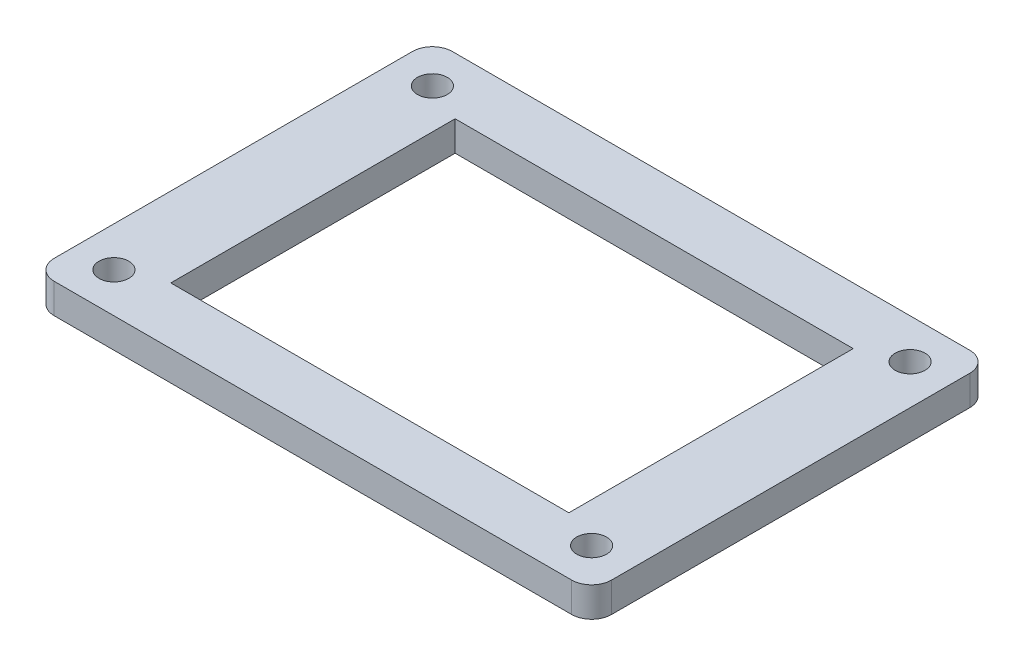
ISO-10303-21;
HEADER;
FILE_DESCRIPTION(('STEP AP214'),'2;1');
FILE_NAME('part.step','',(''),(''),'','','');
FILE_SCHEMA(('AUTOMOTIVE_DESIGN { 1 0 10303 214 1 1 1 1 }'));
ENDSEC;
DATA;
#1=APPLICATION_CONTEXT('core data for automotive mechanical design processes');
#2=APPLICATION_PROTOCOL_DEFINITION('international standard','automotive_design',2000,#1);
#3=PRODUCT_CONTEXT('',#1,'mechanical');
#4=PRODUCT('Part','Part','',(#3));
#5=PRODUCT_RELATED_PRODUCT_CATEGORY('part','',(#4));
#6=PRODUCT_DEFINITION_FORMATION('','',#4);
#7=PRODUCT_DEFINITION_CONTEXT('part definition',#1,'design');
#8=PRODUCT_DEFINITION('design','',#6,#7);
#9=PRODUCT_DEFINITION_SHAPE('','',#8);
#10=(LENGTH_UNIT() NAMED_UNIT(*) SI_UNIT(.MILLI.,.METRE.));
#11=(NAMED_UNIT(*) PLANE_ANGLE_UNIT() SI_UNIT($,.RADIAN.));
#12=(NAMED_UNIT(*) SI_UNIT($,.STERADIAN.) SOLID_ANGLE_UNIT());
#13=UNCERTAINTY_MEASURE_WITH_UNIT(LENGTH_MEASURE(1.E-05),#10,'distance_accuracy_value','');
#14=(GEOMETRIC_REPRESENTATION_CONTEXT(3) GLOBAL_UNCERTAINTY_ASSIGNED_CONTEXT((#13)) GLOBAL_UNIT_ASSIGNED_CONTEXT((#10,
#11,#12)) REPRESENTATION_CONTEXT('',''));
#15=CARTESIAN_POINT('',(0.,0.,0.));
#16=DIRECTION('',(0.,0.,1.));
#17=DIRECTION('',(1.,0.,0.));
#18=AXIS2_PLACEMENT_3D('',#15,#16,#17);
#19=CARTESIAN_POINT('',(0.,3.,0.));
#20=DIRECTION('',(0.,-1.,0.));
#21=DIRECTION('',(0.,0.,-1.));
#22=AXIS2_PLACEMENT_3D('',#19,#20,#21);
#23=PLANE('',#22);
#24=CARTESIAN_POINT('',(-23.9999999999956,3.,-16.0000000000008));
#25=DIRECTION('',(0.,-1.,0.));
#26=DIRECTION('',(0.,0.,-1.));
#27=AXIS2_PLACEMENT_3D('',#24,#25,#26);
#28=CIRCLE('',#27,1.5);
#29=CARTESIAN_POINT('',(-23.9999999999956,3.,-17.5000000000008));
#30=VERTEX_POINT('',#29);
#31=EDGE_CURVE('E429',#30,#30,#28,.T.);
#32=ORIENTED_EDGE('',*,*,#31,.T.);
#33=EDGE_LOOP('',(#32));
#34=FACE_BOUND('',#33,.T.);
#35=CARTESIAN_POINT('',(24.0000000000047,3.,15.9999999999988));
#36=DIRECTION('',(0.,-1.,0.));
#37=DIRECTION('',(0.,0.,-1.));
#38=AXIS2_PLACEMENT_3D('',#35,#36,#37);
#39=CIRCLE('',#38,1.5);
#40=CARTESIAN_POINT('',(24.0000000000047,3.,14.4999999999988));
#41=VERTEX_POINT('',#40);
#42=EDGE_CURVE('E424',#41,#41,#39,.T.);
#43=ORIENTED_EDGE('',*,*,#42,.T.);
#44=EDGE_LOOP('',(#43));
#45=FACE_BOUND('',#44,.T.);
#46=CARTESIAN_POINT('',(24.0000000000045,3.,-16.0000000000012));
#47=DIRECTION('',(0.,-1.,0.));
#48=DIRECTION('',(0.,0.,-1.));
#49=AXIS2_PLACEMENT_3D('',#46,#47,#48);
#50=CIRCLE('',#49,1.5);
#51=CARTESIAN_POINT('',(24.0000000000045,3.,-17.5000000000012));
#52=VERTEX_POINT('',#51);
#53=EDGE_CURVE('E417',#52,#52,#50,.T.);
#54=ORIENTED_EDGE('',*,*,#53,.T.);
#55=EDGE_LOOP('',(#54));
#56=FACE_BOUND('',#55,.T.);
#57=CARTESIAN_POINT('',(-23.9999999999953,3.,15.9999999999992));
#58=DIRECTION('',(0.,-1.,0.));
#59=DIRECTION('',(0.,0.,-1.));
#60=AXIS2_PLACEMENT_3D('',#57,#58,#59);
#61=CIRCLE('',#60,1.5);
#62=CARTESIAN_POINT('',(-23.9999999999953,3.,14.4999999999992));
#63=VERTEX_POINT('',#62);
#64=EDGE_CURVE('E156',#63,#63,#61,.T.);
#65=ORIENTED_EDGE('',*,*,#64,.T.);
#66=EDGE_LOOP('',(#65));
#67=FACE_BOUND('',#66,.T.);
#68=DIRECTION('',(1.,0.,0.));
#69=VECTOR('',#68,1.);
#70=CARTESIAN_POINT('',(-28.,3.,20.));
#71=LINE('',#70,#69);
#72=CARTESIAN_POINT('',(-26.,3.,20.));
#73=VERTEX_POINT('',#72);
#74=CARTESIAN_POINT('',(26.,3.,20.));
#75=VERTEX_POINT('',#74);
#76=EDGE_CURVE('E175',#73,#75,#71,.T.);
#77=ORIENTED_EDGE('',*,*,#76,.T.);
#78=CARTESIAN_POINT('',(26.,3.,18.));
#79=DIRECTION('',(0.,-1.,0.));
#80=DIRECTION('',(0.,0.,-1.));
#81=AXIS2_PLACEMENT_3D('',#78,#79,#80);
#82=CIRCLE('',#81,2.);
#83=CARTESIAN_POINT('',(28.,3.,18.));
#84=VERTEX_POINT('',#83);
#85=EDGE_CURVE('E210',#75,#84,#82,.F.);
#86=ORIENTED_EDGE('',*,*,#85,.T.);
#87=DIRECTION('',(0.,0.,-1.));
#88=VECTOR('',#87,1.);
#89=CARTESIAN_POINT('',(28.,3.,20.));
#90=LINE('',#89,#88);
#91=CARTESIAN_POINT('',(28.,3.,-18.));
#92=VERTEX_POINT('',#91);
#93=EDGE_CURVE('E167',#84,#92,#90,.T.);
#94=ORIENTED_EDGE('',*,*,#93,.T.);
#95=CARTESIAN_POINT('',(26.,3.,-18.));
#96=DIRECTION('',(0.,-1.,0.));
#97=DIRECTION('',(0.,0.,-1.));
#98=AXIS2_PLACEMENT_3D('',#95,#96,#97);
#99=CIRCLE('',#98,2.);
#100=CARTESIAN_POINT('',(26.,3.,-20.));
#101=VERTEX_POINT('',#100);
#102=EDGE_CURVE('E208',#92,#101,#99,.F.);
#103=ORIENTED_EDGE('',*,*,#102,.T.);
#104=DIRECTION('',(-1.,0.,0.));
#105=VECTOR('',#104,1.);
#106=CARTESIAN_POINT('',(-28.,3.,-20.));
#107=LINE('',#106,#105);
#108=CARTESIAN_POINT('',(-26.,3.,-20.));
#109=VERTEX_POINT('',#108);
#110=EDGE_CURVE('E170',#101,#109,#107,.T.);
#111=ORIENTED_EDGE('',*,*,#110,.T.);
#112=CARTESIAN_POINT('',(-26.,3.,-18.));
#113=DIRECTION('',(0.,-1.,0.));
#114=DIRECTION('',(0.,0.,-1.));
#115=AXIS2_PLACEMENT_3D('',#112,#113,#114);
#116=CIRCLE('',#115,2.);
#117=CARTESIAN_POINT('',(-28.,3.,-18.));
#118=VERTEX_POINT('',#117);
#119=EDGE_CURVE('E54',#109,#118,#116,.F.);
#120=ORIENTED_EDGE('',*,*,#119,.T.);
#121=DIRECTION('',(0.,0.,1.));
#122=VECTOR('',#121,1.);
#123=CARTESIAN_POINT('',(-28.,3.,20.));
#124=LINE('',#123,#122);
#125=CARTESIAN_POINT('',(-28.,3.,18.));
#126=VERTEX_POINT('',#125);
#127=EDGE_CURVE('E173',#118,#126,#124,.T.);
#128=ORIENTED_EDGE('',*,*,#127,.T.);
#129=CARTESIAN_POINT('',(-26.,3.,18.));
#130=DIRECTION('',(0.,-1.,0.));
#131=DIRECTION('',(0.,0.,-1.));
#132=AXIS2_PLACEMENT_3D('',#129,#130,#131);
#133=CIRCLE('',#132,2.);
#134=EDGE_CURVE('E205',#126,#73,#133,.F.);
#135=ORIENTED_EDGE('',*,*,#134,.T.);
#136=EDGE_LOOP('',(#77,#86,#94,#103,#111,#120,#128,#135));
#137=FACE_BOUND('',#136,.T.);
#138=DIRECTION('',(0.,0.,-1.));
#139=VECTOR('',#138,1.);
#140=CARTESIAN_POINT('',(20.,3.,14.2857142857143));
#141=LINE('',#140,#139);
#142=CARTESIAN_POINT('',(20.,3.,14.2857142857143));
#143=VERTEX_POINT('',#142);
#144=CARTESIAN_POINT('',(20.,3.,-14.2857142857143));
#145=VERTEX_POINT('',#144);
#146=EDGE_CURVE('E124',#143,#145,#141,.T.);
#147=ORIENTED_EDGE('',*,*,#146,.F.);
#148=DIRECTION('',(1.,0.,0.));
#149=VECTOR('',#148,1.);
#150=CARTESIAN_POINT('',(-20.,3.,14.2857142857143));
#151=LINE('',#150,#149);
#152=CARTESIAN_POINT('',(-20.,3.,14.2857142857143));
#153=VERTEX_POINT('',#152);
#154=EDGE_CURVE('E149',#153,#143,#151,.T.);
#155=ORIENTED_EDGE('',*,*,#154,.F.);
#156=DIRECTION('',(0.,0.,1.));
#157=VECTOR('',#156,1.);
#158=CARTESIAN_POINT('',(-20.,3.,14.2857142857143));
#159=LINE('',#158,#157);
#160=CARTESIAN_POINT('',(-20.,3.,-14.2857142857143));
#161=VERTEX_POINT('',#160);
#162=EDGE_CURVE('E147',#161,#153,#159,.T.);
#163=ORIENTED_EDGE('',*,*,#162,.F.);
#164=DIRECTION('',(-1.,0.,0.));
#165=VECTOR('',#164,1.);
#166=CARTESIAN_POINT('',(-20.,3.,-14.2857142857143));
#167=LINE('',#166,#165);
#168=EDGE_CURVE('E134',#145,#161,#167,.T.);
#169=ORIENTED_EDGE('',*,*,#168,.F.);
#170=EDGE_LOOP('',(#147,#155,#163,#169));
#171=FACE_BOUND('',#170,.T.);
#172=ADVANCED_FACE('F33',(#34,#45,#56,#67,#137,#171),#23,.F.);
#173=CARTESIAN_POINT('',(0.,0.,0.));
#174=DIRECTION('',(0.,-1.,0.));
#175=DIRECTION('',(0.,0.,-1.));
#176=AXIS2_PLACEMENT_3D('',#173,#174,#175);
#177=PLANE('',#176);
#178=CARTESIAN_POINT('',(-23.9999999999956,0.,-16.0000000000008));
#179=DIRECTION('',(0.,-1.,0.));
#180=DIRECTION('',(0.,0.,-1.));
#181=AXIS2_PLACEMENT_3D('',#178,#179,#180);
#182=CIRCLE('',#181,1.5);
#183=CARTESIAN_POINT('',(-23.9999999999956,0.,-17.5000000000008));
#184=VERTEX_POINT('',#183);
#185=EDGE_CURVE('E432',#184,#184,#182,.T.);
#186=ORIENTED_EDGE('',*,*,#185,.F.);
#187=EDGE_LOOP('',(#186));
#188=FACE_BOUND('',#187,.T.);
#189=CARTESIAN_POINT('',(24.0000000000047,0.,15.9999999999988));
#190=DIRECTION('',(0.,-1.,0.));
#191=DIRECTION('',(0.,0.,-1.));
#192=AXIS2_PLACEMENT_3D('',#189,#190,#191);
#193=CIRCLE('',#192,1.5);
#194=CARTESIAN_POINT('',(24.0000000000047,0.,14.4999999999988));
#195=VERTEX_POINT('',#194);
#196=EDGE_CURVE('E426',#195,#195,#193,.T.);
#197=ORIENTED_EDGE('',*,*,#196,.F.);
#198=EDGE_LOOP('',(#197));
#199=FACE_BOUND('',#198,.T.);
#200=CARTESIAN_POINT('',(24.0000000000045,0.,-16.0000000000012));
#201=DIRECTION('',(0.,-1.,0.));
#202=DIRECTION('',(0.,0.,-1.));
#203=AXIS2_PLACEMENT_3D('',#200,#201,#202);
#204=CIRCLE('',#203,1.5);
#205=CARTESIAN_POINT('',(24.0000000000045,0.,-17.5000000000012));
#206=VERTEX_POINT('',#205);
#207=EDGE_CURVE('E420',#206,#206,#204,.T.);
#208=ORIENTED_EDGE('',*,*,#207,.F.);
#209=EDGE_LOOP('',(#208));
#210=FACE_BOUND('',#209,.T.);
#211=CARTESIAN_POINT('',(-23.9999999999953,0.,15.9999999999992));
#212=DIRECTION('',(0.,-1.,0.));
#213=DIRECTION('',(0.,0.,-1.));
#214=AXIS2_PLACEMENT_3D('',#211,#212,#213);
#215=CIRCLE('',#214,1.5);
#216=CARTESIAN_POINT('',(-23.9999999999953,0.,14.4999999999992));
#217=VERTEX_POINT('',#216);
#218=EDGE_CURVE('E415',#217,#217,#215,.T.);
#219=ORIENTED_EDGE('',*,*,#218,.F.);
#220=EDGE_LOOP('',(#219));
#221=FACE_BOUND('',#220,.T.);
#222=DIRECTION('',(0.,0.,-1.));
#223=VECTOR('',#222,1.);
#224=CARTESIAN_POINT('',(28.,0.,20.));
#225=LINE('',#224,#223);
#226=CARTESIAN_POINT('',(28.,0.,18.));
#227=VERTEX_POINT('',#226);
#228=CARTESIAN_POINT('',(28.,0.,-18.));
#229=VERTEX_POINT('',#228);
#230=EDGE_CURVE('E142',#227,#229,#225,.T.);
#231=ORIENTED_EDGE('',*,*,#230,.F.);
#232=CARTESIAN_POINT('',(26.,0.,18.));
#233=DIRECTION('',(0.,-1.,0.));
#234=DIRECTION('',(0.,0.,-1.));
#235=AXIS2_PLACEMENT_3D('',#232,#233,#234);
#236=CIRCLE('',#235,2.);
#237=CARTESIAN_POINT('',(26.,0.,20.));
#238=VERTEX_POINT('',#237);
#239=EDGE_CURVE('E198',#227,#238,#236,.T.);
#240=ORIENTED_EDGE('',*,*,#239,.T.);
#241=DIRECTION('',(1.,0.,0.));
#242=VECTOR('',#241,1.);
#243=CARTESIAN_POINT('',(-28.,0.,20.));
#244=LINE('',#243,#242);
#245=CARTESIAN_POINT('',(-26.,0.,20.));
#246=VERTEX_POINT('',#245);
#247=EDGE_CURVE('E171',#246,#238,#244,.T.);
#248=ORIENTED_EDGE('',*,*,#247,.F.);
#249=CARTESIAN_POINT('',(-26.,0.,18.));
#250=DIRECTION('',(0.,-1.,0.));
#251=DIRECTION('',(0.,0.,-1.));
#252=AXIS2_PLACEMENT_3D('',#249,#250,#251);
#253=CIRCLE('',#252,2.);
#254=CARTESIAN_POINT('',(-28.,0.,18.));
#255=VERTEX_POINT('',#254);
#256=EDGE_CURVE('E192',#246,#255,#253,.T.);
#257=ORIENTED_EDGE('',*,*,#256,.T.);
#258=DIRECTION('',(0.,0.,1.));
#259=VECTOR('',#258,1.);
#260=CARTESIAN_POINT('',(-28.,0.,20.));
#261=LINE('',#260,#259);
#262=CARTESIAN_POINT('',(-28.,0.,-18.));
#263=VERTEX_POINT('',#262);
#264=EDGE_CURVE('E184',#263,#255,#261,.T.);
#265=ORIENTED_EDGE('',*,*,#264,.F.);
#266=CARTESIAN_POINT('',(-26.,0.,-18.));
#267=DIRECTION('',(0.,-1.,0.));
#268=DIRECTION('',(0.,0.,-1.));
#269=AXIS2_PLACEMENT_3D('',#266,#267,#268);
#270=CIRCLE('',#269,2.);
#271=CARTESIAN_POINT('',(-26.,0.,-20.));
#272=VERTEX_POINT('',#271);
#273=EDGE_CURVE('E194',#263,#272,#270,.T.);
#274=ORIENTED_EDGE('',*,*,#273,.T.);
#275=DIRECTION('',(-1.,0.,0.));
#276=VECTOR('',#275,1.);
#277=CARTESIAN_POINT('',(-28.,0.,-20.));
#278=LINE('',#277,#276);
#279=CARTESIAN_POINT('',(26.,0.,-20.));
#280=VERTEX_POINT('',#279);
#281=EDGE_CURVE('E181',#280,#272,#278,.T.);
#282=ORIENTED_EDGE('',*,*,#281,.F.);
#283=CARTESIAN_POINT('',(26.,0.,-18.));
#284=DIRECTION('',(0.,-1.,0.));
#285=DIRECTION('',(0.,0.,-1.));
#286=AXIS2_PLACEMENT_3D('',#283,#284,#285);
#287=CIRCLE('',#286,2.);
#288=EDGE_CURVE('E196',#280,#229,#287,.T.);
#289=ORIENTED_EDGE('',*,*,#288,.T.);
#290=EDGE_LOOP('',(#231,#240,#248,#257,#265,#274,#282,#289));
#291=FACE_BOUND('',#290,.T.);
#292=DIRECTION('',(1.,0.,0.));
#293=VECTOR('',#292,1.);
#294=CARTESIAN_POINT('',(-20.,0.,14.2857142857143));
#295=LINE('',#294,#293);
#296=CARTESIAN_POINT('',(-20.,0.,14.2857142857143));
#297=VERTEX_POINT('',#296);
#298=CARTESIAN_POINT('',(20.,0.,14.2857142857143));
#299=VERTEX_POINT('',#298);
#300=EDGE_CURVE('E135',#297,#299,#295,.T.);
#301=ORIENTED_EDGE('',*,*,#300,.T.);
#302=DIRECTION('',(0.,0.,-1.));
#303=VECTOR('',#302,1.);
#304=CARTESIAN_POINT('',(20.,0.,14.2857142857143));
#305=LINE('',#304,#303);
#306=CARTESIAN_POINT('',(20.,0.,-14.2857142857143));
#307=VERTEX_POINT('',#306);
#308=EDGE_CURVE('E154',#299,#307,#305,.T.);
#309=ORIENTED_EDGE('',*,*,#308,.T.);
#310=DIRECTION('',(-1.,0.,0.));
#311=VECTOR('',#310,1.);
#312=CARTESIAN_POINT('',(-20.,0.,-14.2857142857143));
#313=LINE('',#312,#311);
#314=CARTESIAN_POINT('',(-20.,0.,-14.2857142857143));
#315=VERTEX_POINT('',#314);
#316=EDGE_CURVE('E141',#307,#315,#313,.T.);
#317=ORIENTED_EDGE('',*,*,#316,.T.);
#318=DIRECTION('',(0.,0.,1.));
#319=VECTOR('',#318,1.);
#320=CARTESIAN_POINT('',(-20.,0.,14.2857142857143));
#321=LINE('',#320,#319);
#322=EDGE_CURVE('E158',#315,#297,#321,.T.);
#323=ORIENTED_EDGE('',*,*,#322,.T.);
#324=EDGE_LOOP('',(#301,#309,#317,#323));
#325=FACE_BOUND('',#324,.T.);
#326=ADVANCED_FACE('F226',(#188,#199,#210,#221,#291,#325),#177,.T.);
#327=CARTESIAN_POINT('',(28.,3.,20.));
#328=DIRECTION('',(-1.,0.,0.));
#329=DIRECTION('',(0.,0.,1.));
#330=AXIS2_PLACEMENT_3D('',#327,#328,#329);
#331=PLANE('',#330);
#332=ORIENTED_EDGE('',*,*,#93,.F.);
#333=DIRECTION('',(0.,-1.,0.));
#334=VECTOR('',#333,1.);
#335=CARTESIAN_POINT('',(28.,3.,18.));
#336=LINE('',#335,#334);
#337=EDGE_CURVE('E189',#84,#227,#336,.T.);
#338=ORIENTED_EDGE('',*,*,#337,.T.);
#339=ORIENTED_EDGE('',*,*,#230,.T.);
#340=DIRECTION('',(0.,-1.,0.));
#341=VECTOR('',#340,1.);
#342=CARTESIAN_POINT('',(28.,3.,-18.));
#343=LINE('',#342,#341);
#344=EDGE_CURVE('E178',#229,#92,#343,.F.);
#345=ORIENTED_EDGE('',*,*,#344,.T.);
#346=EDGE_LOOP('',(#332,#338,#339,#345));
#347=FACE_BOUND('',#346,.T.);
#348=ADVANCED_FACE('F247',(#347),#331,.F.);
#349=CARTESIAN_POINT('',(-28.,3.,-20.));
#350=DIRECTION('',(0.,0.,1.));
#351=DIRECTION('',(1.,0.,0.));
#352=AXIS2_PLACEMENT_3D('',#349,#350,#351);
#353=PLANE('',#352);
#354=ORIENTED_EDGE('',*,*,#110,.F.);
#355=DIRECTION('',(0.,-1.,0.));
#356=VECTOR('',#355,1.);
#357=CARTESIAN_POINT('',(26.,3.,-20.));
#358=LINE('',#357,#356);
#359=EDGE_CURVE('E214',#101,#280,#358,.T.);
#360=ORIENTED_EDGE('',*,*,#359,.T.);
#361=ORIENTED_EDGE('',*,*,#281,.T.);
#362=DIRECTION('',(0.,-1.,0.));
#363=VECTOR('',#362,1.);
#364=CARTESIAN_POINT('',(-26.,3.,-20.));
#365=LINE('',#364,#363);
#366=EDGE_CURVE('E212',#272,#109,#365,.F.);
#367=ORIENTED_EDGE('',*,*,#366,.T.);
#368=EDGE_LOOP('',(#354,#360,#361,#367));
#369=FACE_BOUND('',#368,.T.);
#370=ADVANCED_FACE('F220',(#369),#353,.F.);
#371=CARTESIAN_POINT('',(-28.,3.,20.));
#372=DIRECTION('',(1.,0.,0.));
#373=DIRECTION('',(0.,0.,-1.));
#374=AXIS2_PLACEMENT_3D('',#371,#372,#373);
#375=PLANE('',#374);
#376=ORIENTED_EDGE('',*,*,#127,.F.);
#377=DIRECTION('',(0.,-1.,0.));
#378=VECTOR('',#377,1.);
#379=CARTESIAN_POINT('',(-28.,3.,-18.));
#380=LINE('',#379,#378);
#381=EDGE_CURVE('E11',#118,#263,#380,.T.);
#382=ORIENTED_EDGE('',*,*,#381,.T.);
#383=ORIENTED_EDGE('',*,*,#264,.T.);
#384=DIRECTION('',(0.,-1.,0.));
#385=VECTOR('',#384,1.);
#386=CARTESIAN_POINT('',(-28.,3.,18.));
#387=LINE('',#386,#385);
#388=EDGE_CURVE('E41',#255,#126,#387,.F.);
#389=ORIENTED_EDGE('',*,*,#388,.T.);
#390=EDGE_LOOP('',(#376,#382,#383,#389));
#391=FACE_BOUND('',#390,.T.);
#392=ADVANCED_FACE('F232',(#391),#375,.F.);
#393=CARTESIAN_POINT('',(-28.,3.,20.));
#394=DIRECTION('',(0.,0.,-1.));
#395=DIRECTION('',(-1.,0.,0.));
#396=AXIS2_PLACEMENT_3D('',#393,#394,#395);
#397=PLANE('',#396);
#398=ORIENTED_EDGE('',*,*,#247,.T.);
#399=DIRECTION('',(0.,-1.,0.));
#400=VECTOR('',#399,1.);
#401=CARTESIAN_POINT('',(26.,3.,20.));
#402=LINE('',#401,#400);
#403=EDGE_CURVE('E203',#238,#75,#402,.F.);
#404=ORIENTED_EDGE('',*,*,#403,.T.);
#405=ORIENTED_EDGE('',*,*,#76,.F.);
#406=DIRECTION('',(0.,-1.,0.));
#407=VECTOR('',#406,1.);
#408=CARTESIAN_POINT('',(-26.,3.,20.));
#409=LINE('',#408,#407);
#410=EDGE_CURVE('E200',#73,#246,#409,.T.);
#411=ORIENTED_EDGE('',*,*,#410,.T.);
#412=EDGE_LOOP('',(#398,#404,#405,#411));
#413=FACE_BOUND('',#412,.T.);
#414=ADVANCED_FACE('F239',(#413),#397,.F.);
#415=CARTESIAN_POINT('',(20.,3.,14.2857142857143));
#416=DIRECTION('',(-1.,0.,0.));
#417=DIRECTION('',(0.,0.,1.));
#418=AXIS2_PLACEMENT_3D('',#415,#416,#417);
#419=PLANE('',#418);
#420=ORIENTED_EDGE('',*,*,#308,.F.);
#421=DIRECTION('',(0.,-1.,0.));
#422=VECTOR('',#421,1.);
#423=CARTESIAN_POINT('',(20.,3.,14.2857142857143));
#424=LINE('',#423,#422);
#425=EDGE_CURVE('E130',#143,#299,#424,.T.);
#426=ORIENTED_EDGE('',*,*,#425,.F.);
#427=ORIENTED_EDGE('',*,*,#146,.T.);
#428=DIRECTION('',(0.,-1.,0.));
#429=VECTOR('',#428,1.);
#430=CARTESIAN_POINT('',(20.,3.,-14.2857142857143));
#431=LINE('',#430,#429);
#432=EDGE_CURVE('E127',#145,#307,#431,.T.);
#433=ORIENTED_EDGE('',*,*,#432,.T.);
#434=EDGE_LOOP('',(#420,#426,#427,#433));
#435=FACE_BOUND('',#434,.T.);
#436=ADVANCED_FACE('F126',(#435),#419,.T.);
#437=CARTESIAN_POINT('',(-20.,3.,-14.2857142857143));
#438=DIRECTION('',(0.,0.,1.));
#439=DIRECTION('',(1.,0.,0.));
#440=AXIS2_PLACEMENT_3D('',#437,#438,#439);
#441=PLANE('',#440);
#442=ORIENTED_EDGE('',*,*,#316,.F.);
#443=ORIENTED_EDGE('',*,*,#432,.F.);
#444=ORIENTED_EDGE('',*,*,#168,.T.);
#445=DIRECTION('',(0.,-1.,0.));
#446=VECTOR('',#445,1.);
#447=CARTESIAN_POINT('',(-20.,3.,-14.2857142857143));
#448=LINE('',#447,#446);
#449=EDGE_CURVE('E143',#161,#315,#448,.T.);
#450=ORIENTED_EDGE('',*,*,#449,.T.);
#451=EDGE_LOOP('',(#442,#443,#444,#450));
#452=FACE_BOUND('',#451,.T.);
#453=ADVANCED_FACE('F138',(#452),#441,.T.);
#454=CARTESIAN_POINT('',(-20.,3.,14.2857142857143));
#455=DIRECTION('',(1.,0.,0.));
#456=DIRECTION('',(0.,0.,-1.));
#457=AXIS2_PLACEMENT_3D('',#454,#455,#456);
#458=PLANE('',#457);
#459=ORIENTED_EDGE('',*,*,#322,.F.);
#460=ORIENTED_EDGE('',*,*,#449,.F.);
#461=ORIENTED_EDGE('',*,*,#162,.T.);
#462=DIRECTION('',(0.,-1.,0.));
#463=VECTOR('',#462,1.);
#464=CARTESIAN_POINT('',(-20.,3.,14.2857142857143));
#465=LINE('',#464,#463);
#466=EDGE_CURVE('E164',#153,#297,#465,.T.);
#467=ORIENTED_EDGE('',*,*,#466,.T.);
#468=EDGE_LOOP('',(#459,#460,#461,#467));
#469=FACE_BOUND('',#468,.T.);
#470=ADVANCED_FACE('F356',(#469),#458,.T.);
#471=CARTESIAN_POINT('',(-20.,3.,14.2857142857143));
#472=DIRECTION('',(0.,0.,-1.));
#473=DIRECTION('',(-1.,0.,0.));
#474=AXIS2_PLACEMENT_3D('',#471,#472,#473);
#475=PLANE('',#474);
#476=ORIENTED_EDGE('',*,*,#300,.F.);
#477=ORIENTED_EDGE('',*,*,#466,.F.);
#478=ORIENTED_EDGE('',*,*,#154,.T.);
#479=ORIENTED_EDGE('',*,*,#425,.T.);
#480=EDGE_LOOP('',(#476,#477,#478,#479));
#481=FACE_BOUND('',#480,.T.);
#482=ADVANCED_FACE('F348',(#481),#475,.T.);
#483=CARTESIAN_POINT('',(-23.9999999999953,3.,15.9999999999992));
#484=DIRECTION('',(0.,-1.,0.));
#485=DIRECTION('',(0.,0.,-1.));
#486=AXIS2_PLACEMENT_3D('',#483,#484,#485);
#487=CYLINDRICAL_SURFACE('',#486,1.5);
#488=ORIENTED_EDGE('',*,*,#64,.F.);
#489=EDGE_LOOP('',(#488));
#490=FACE_BOUND('',#489,.T.);
#491=ORIENTED_EDGE('',*,*,#218,.T.);
#492=EDGE_LOOP('',(#491));
#493=FACE_BOUND('',#492,.T.);
#494=ADVANCED_FACE('F340',(#490,#493),#487,.F.);
#495=CARTESIAN_POINT('',(24.0000000000045,3.,-16.0000000000012));
#496=DIRECTION('',(0.,-1.,0.));
#497=DIRECTION('',(0.,0.,-1.));
#498=AXIS2_PLACEMENT_3D('',#495,#496,#497);
#499=CYLINDRICAL_SURFACE('',#498,1.5);
#500=ORIENTED_EDGE('',*,*,#53,.F.);
#501=EDGE_LOOP('',(#500));
#502=FACE_BOUND('',#501,.T.);
#503=ORIENTED_EDGE('',*,*,#207,.T.);
#504=EDGE_LOOP('',(#503));
#505=FACE_BOUND('',#504,.T.);
#506=ADVANCED_FACE('F332',(#502,#505),#499,.F.);
#507=CARTESIAN_POINT('',(24.0000000000047,3.,15.9999999999988));
#508=DIRECTION('',(0.,-1.,0.));
#509=DIRECTION('',(0.,0.,-1.));
#510=AXIS2_PLACEMENT_3D('',#507,#508,#509);
#511=CYLINDRICAL_SURFACE('',#510,1.5);
#512=ORIENTED_EDGE('',*,*,#42,.F.);
#513=EDGE_LOOP('',(#512));
#514=FACE_BOUND('',#513,.T.);
#515=ORIENTED_EDGE('',*,*,#196,.T.);
#516=EDGE_LOOP('',(#515));
#517=FACE_BOUND('',#516,.T.);
#518=ADVANCED_FACE('F325',(#514,#517),#511,.F.);
#519=CARTESIAN_POINT('',(-23.9999999999956,3.,-16.0000000000008));
#520=DIRECTION('',(0.,-1.,0.));
#521=DIRECTION('',(0.,0.,-1.));
#522=AXIS2_PLACEMENT_3D('',#519,#520,#521);
#523=CYLINDRICAL_SURFACE('',#522,1.5);
#524=ORIENTED_EDGE('',*,*,#31,.F.);
#525=EDGE_LOOP('',(#524));
#526=FACE_BOUND('',#525,.T.);
#527=ORIENTED_EDGE('',*,*,#185,.T.);
#528=EDGE_LOOP('',(#527));
#529=FACE_BOUND('',#528,.T.);
#530=ADVANCED_FACE('F256',(#526,#529),#523,.F.);
#531=CARTESIAN_POINT('',(26.,3.,18.));
#532=DIRECTION('',(0.,-1.,0.));
#533=DIRECTION('',(0.,0.,-1.));
#534=AXIS2_PLACEMENT_3D('',#531,#532,#533);
#535=CYLINDRICAL_SURFACE('',#534,2.);
#536=ORIENTED_EDGE('',*,*,#85,.F.);
#537=ORIENTED_EDGE('',*,*,#403,.F.);
#538=ORIENTED_EDGE('',*,*,#239,.F.);
#539=ORIENTED_EDGE('',*,*,#337,.F.);
#540=EDGE_LOOP('',(#536,#537,#538,#539));
#541=FACE_BOUND('',#540,.T.);
#542=ADVANCED_FACE('F244',(#541),#535,.T.);
#543=CARTESIAN_POINT('',(26.,3.,-18.));
#544=DIRECTION('',(0.,-1.,0.));
#545=DIRECTION('',(0.,0.,-1.));
#546=AXIS2_PLACEMENT_3D('',#543,#544,#545);
#547=CYLINDRICAL_SURFACE('',#546,2.);
#548=ORIENTED_EDGE('',*,*,#102,.F.);
#549=ORIENTED_EDGE('',*,*,#344,.F.);
#550=ORIENTED_EDGE('',*,*,#288,.F.);
#551=ORIENTED_EDGE('',*,*,#359,.F.);
#552=EDGE_LOOP('',(#548,#549,#550,#551));
#553=FACE_BOUND('',#552,.T.);
#554=ADVANCED_FACE('F249',(#553),#547,.T.);
#555=CARTESIAN_POINT('',(-26.,3.,-18.));
#556=DIRECTION('',(0.,-1.,0.));
#557=DIRECTION('',(0.,0.,-1.));
#558=AXIS2_PLACEMENT_3D('',#555,#556,#557);
#559=CYLINDRICAL_SURFACE('',#558,2.);
#560=ORIENTED_EDGE('',*,*,#119,.F.);
#561=ORIENTED_EDGE('',*,*,#366,.F.);
#562=ORIENTED_EDGE('',*,*,#273,.F.);
#563=ORIENTED_EDGE('',*,*,#381,.F.);
#564=EDGE_LOOP('',(#560,#561,#562,#563));
#565=FACE_BOUND('',#564,.T.);
#566=ADVANCED_FACE('F231',(#565),#559,.T.);
#567=CARTESIAN_POINT('',(-26.,3.,18.));
#568=DIRECTION('',(0.,-1.,0.));
#569=DIRECTION('',(0.,0.,-1.));
#570=AXIS2_PLACEMENT_3D('',#567,#568,#569);
#571=CYLINDRICAL_SURFACE('',#570,2.);
#572=ORIENTED_EDGE('',*,*,#134,.F.);
#573=ORIENTED_EDGE('',*,*,#388,.F.);
#574=ORIENTED_EDGE('',*,*,#256,.F.);
#575=ORIENTED_EDGE('',*,*,#410,.F.);
#576=EDGE_LOOP('',(#572,#573,#574,#575));
#577=FACE_BOUND('',#576,.T.);
#578=ADVANCED_FACE('F35',(#577),#571,.T.);
#579=CLOSED_SHELL('',(#172,#326,#348,#370,#392,#414,#436,#453,#470,#482,#494,#506,#518,#530,
#542,#554,#566,#578));
#580=MANIFOLD_SOLID_BREP('B2',#579);
#581=ADVANCED_BREP_SHAPE_REPRESENTATION('',(#18,#580),#14);
#582=SHAPE_DEFINITION_REPRESENTATION(#9,#581);
ENDSEC;
END-ISO-10303-21;
